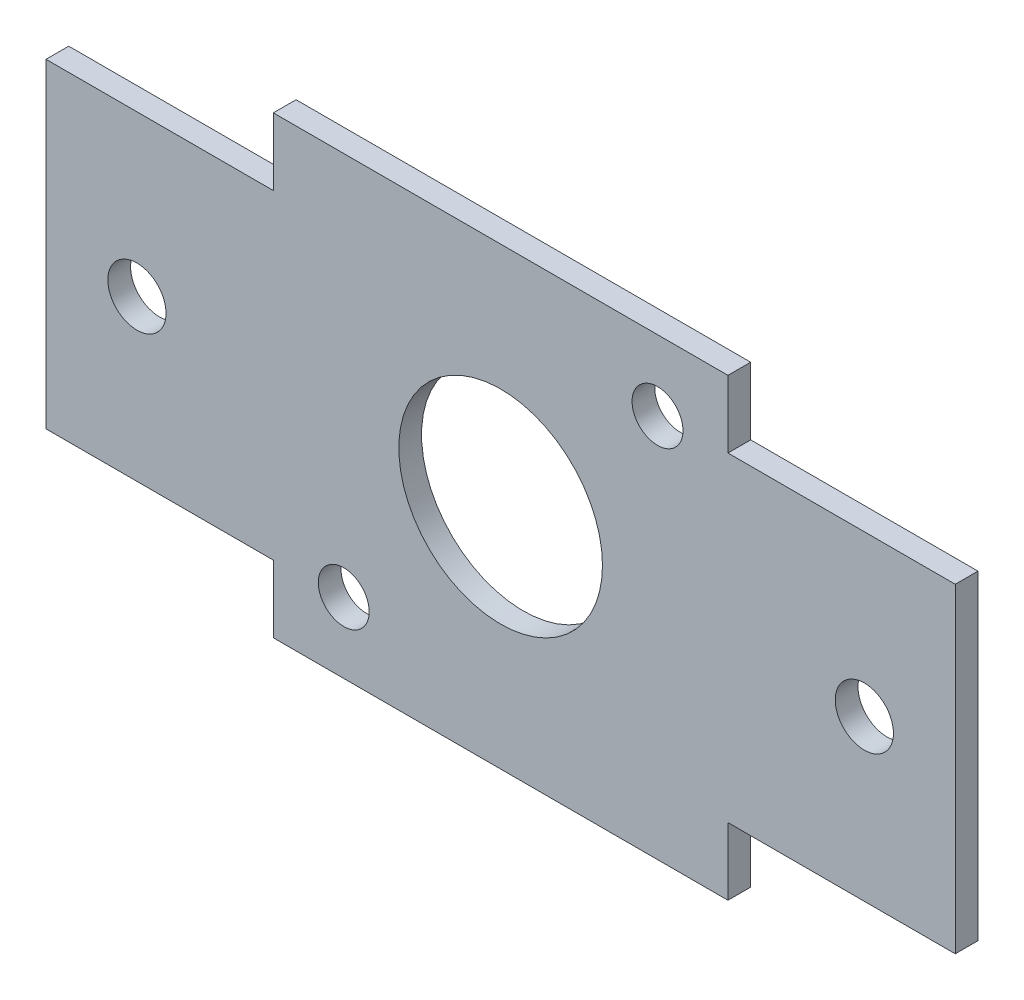
ISO-10303-21;
HEADER;
FILE_DESCRIPTION(('STEP AP214'),'2;1');
FILE_NAME('part.step','',(''),(''),'','','');
FILE_SCHEMA(('AUTOMOTIVE_DESIGN { 1 0 10303 214 1 1 1 1 }'));
ENDSEC;
DATA;
#1=APPLICATION_CONTEXT('core data for automotive mechanical design processes');
#2=APPLICATION_PROTOCOL_DEFINITION('international standard','automotive_design',2000,#1);
#3=PRODUCT_CONTEXT('',#1,'mechanical');
#4=PRODUCT('Part','Part','',(#3));
#5=PRODUCT_RELATED_PRODUCT_CATEGORY('part','',(#4));
#6=PRODUCT_DEFINITION_FORMATION('','',#4);
#7=PRODUCT_DEFINITION_CONTEXT('part definition',#1,'design');
#8=PRODUCT_DEFINITION('design','',#6,#7);
#9=PRODUCT_DEFINITION_SHAPE('','',#8);
#10=(LENGTH_UNIT() NAMED_UNIT(*) SI_UNIT(.MILLI.,.METRE.));
#11=(NAMED_UNIT(*) PLANE_ANGLE_UNIT() SI_UNIT($,.RADIAN.));
#12=(NAMED_UNIT(*) SI_UNIT($,.STERADIAN.) SOLID_ANGLE_UNIT());
#13=UNCERTAINTY_MEASURE_WITH_UNIT(LENGTH_MEASURE(1.E-05),#10,'distance_accuracy_value','');
#14=(GEOMETRIC_REPRESENTATION_CONTEXT(3) GLOBAL_UNCERTAINTY_ASSIGNED_CONTEXT((#13)) GLOBAL_UNIT_ASSIGNED_CONTEXT((#10,
#11,#12)) REPRESENTATION_CONTEXT('',''));
#15=CARTESIAN_POINT('',(0.,0.,0.));
#16=DIRECTION('',(0.,0.,1.));
#17=DIRECTION('',(1.,0.,0.));
#18=AXIS2_PLACEMENT_3D('',#15,#16,#17);
#19=CARTESIAN_POINT('',(-31.75,0.,1.5875));
#20=DIRECTION('',(-1.,0.,0.));
#21=DIRECTION('',(0.,0.,1.));
#22=AXIS2_PLACEMENT_3D('',#19,#20,#21);
#23=PLANE('',#22);
#24=DIRECTION('',(0.,1.,0.));
#25=VECTOR('',#24,1.);
#26=CARTESIAN_POINT('',(-31.75,0.,0.));
#27=LINE('',#26,#25);
#28=CARTESIAN_POINT('',(-31.75,-11.176,0.));
#29=VERTEX_POINT('',#28);
#30=CARTESIAN_POINT('',(-31.75,11.176,0.));
#31=VERTEX_POINT('',#30);
#32=EDGE_CURVE('E239',#29,#31,#27,.T.);
#33=ORIENTED_EDGE('',*,*,#32,.F.);
#34=DIRECTION('',(0.,0.,-1.));
#35=VECTOR('',#34,1.);
#36=CARTESIAN_POINT('',(-31.75,-11.176,1.5875));
#37=LINE('',#36,#35);
#38=CARTESIAN_POINT('',(-31.75,-11.176,1.5875));
#39=VERTEX_POINT('',#38);
#40=EDGE_CURVE('E11',#39,#29,#37,.T.);
#41=ORIENTED_EDGE('',*,*,#40,.F.);
#42=DIRECTION('',(0.,1.,0.));
#43=VECTOR('',#42,1.);
#44=CARTESIAN_POINT('',(-31.75,0.,1.5875));
#45=LINE('',#44,#43);
#46=CARTESIAN_POINT('',(-31.75,11.176,1.5875));
#47=VERTEX_POINT('',#46);
#48=EDGE_CURVE('E176',#39,#47,#45,.T.);
#49=ORIENTED_EDGE('',*,*,#48,.T.);
#50=DIRECTION('',(0.,0.,-1.));
#51=VECTOR('',#50,1.);
#52=CARTESIAN_POINT('',(-31.75,11.176,1.5875));
#53=LINE('',#52,#51);
#54=EDGE_CURVE('E103',#47,#31,#53,.T.);
#55=ORIENTED_EDGE('',*,*,#54,.T.);
#56=EDGE_LOOP('',(#33,#41,#49,#55));
#57=FACE_BOUND('',#56,.T.);
#58=ADVANCED_FACE('F39',(#57),#23,.T.);
#59=CARTESIAN_POINT('',(0.,-11.176,1.5875));
#60=DIRECTION('',(0.,-1.,0.));
#61=DIRECTION('',(0.,0.,-1.));
#62=AXIS2_PLACEMENT_3D('',#59,#60,#61);
#63=PLANE('',#62);
#64=DIRECTION('',(-1.,0.,0.));
#65=VECTOR('',#64,1.);
#66=CARTESIAN_POINT('',(0.,-11.176,0.));
#67=LINE('',#66,#65);
#68=CARTESIAN_POINT('',(-15.875,-11.176,0.));
#69=VERTEX_POINT('',#68);
#70=EDGE_CURVE('E234',#69,#29,#67,.T.);
#71=ORIENTED_EDGE('',*,*,#70,.F.);
#72=DIRECTION('',(0.,0.,-1.));
#73=VECTOR('',#72,1.);
#74=CARTESIAN_POINT('',(-15.875,-11.176,1.5875));
#75=LINE('',#74,#73);
#76=CARTESIAN_POINT('',(-15.875,-11.176,1.5875));
#77=VERTEX_POINT('',#76);
#78=EDGE_CURVE('E49',#77,#69,#75,.T.);
#79=ORIENTED_EDGE('',*,*,#78,.F.);
#80=DIRECTION('',(-1.,0.,0.));
#81=VECTOR('',#80,1.);
#82=CARTESIAN_POINT('',(0.,-11.176,1.5875));
#83=LINE('',#82,#81);
#84=EDGE_CURVE('E168',#77,#39,#83,.T.);
#85=ORIENTED_EDGE('',*,*,#84,.T.);
#86=ORIENTED_EDGE('',*,*,#40,.T.);
#87=EDGE_LOOP('',(#71,#79,#85,#86));
#88=FACE_BOUND('',#87,.T.);
#89=ADVANCED_FACE('F235',(#88),#63,.T.);
#90=CARTESIAN_POINT('',(-15.875,0.,1.5875));
#91=DIRECTION('',(-1.,0.,0.));
#92=DIRECTION('',(0.,0.,1.));
#93=AXIS2_PLACEMENT_3D('',#90,#91,#92);
#94=PLANE('',#93);
#95=DIRECTION('',(0.,1.,0.));
#96=VECTOR('',#95,1.);
#97=CARTESIAN_POINT('',(-15.875,0.,0.));
#98=LINE('',#97,#96);
#99=CARTESIAN_POINT('',(-15.875,-15.875,0.));
#100=VERTEX_POINT('',#99);
#101=EDGE_CURVE('E232',#100,#69,#98,.T.);
#102=ORIENTED_EDGE('',*,*,#101,.F.);
#103=DIRECTION('',(0.,0.,-1.));
#104=VECTOR('',#103,1.);
#105=CARTESIAN_POINT('',(-15.875,-15.875,1.5875));
#106=LINE('',#105,#104);
#107=CARTESIAN_POINT('',(-15.875,-15.875,1.5875));
#108=VERTEX_POINT('',#107);
#109=EDGE_CURVE('E225',#108,#100,#106,.T.);
#110=ORIENTED_EDGE('',*,*,#109,.F.);
#111=DIRECTION('',(0.,1.,0.));
#112=VECTOR('',#111,1.);
#113=CARTESIAN_POINT('',(-15.875,0.,1.5875));
#114=LINE('',#113,#112);
#115=EDGE_CURVE('E159',#108,#77,#114,.T.);
#116=ORIENTED_EDGE('',*,*,#115,.T.);
#117=ORIENTED_EDGE('',*,*,#78,.T.);
#118=EDGE_LOOP('',(#102,#110,#116,#117));
#119=FACE_BOUND('',#118,.T.);
#120=ADVANCED_FACE('F230',(#119),#94,.T.);
#121=CARTESIAN_POINT('',(0.,-15.875,1.5875));
#122=DIRECTION('',(0.,1.,0.));
#123=DIRECTION('',(0.,0.,1.));
#124=AXIS2_PLACEMENT_3D('',#121,#122,#123);
#125=PLANE('',#124);
#126=DIRECTION('',(1.,0.,0.));
#127=VECTOR('',#126,1.);
#128=CARTESIAN_POINT('',(0.,-15.875,0.));
#129=LINE('',#128,#127);
#130=CARTESIAN_POINT('',(15.875,-15.875,0.));
#131=VERTEX_POINT('',#130);
#132=EDGE_CURVE('E245',#100,#131,#129,.T.);
#133=ORIENTED_EDGE('',*,*,#132,.T.);
#134=DIRECTION('',(0.,0.,-1.));
#135=VECTOR('',#134,1.);
#136=CARTESIAN_POINT('',(15.875,-15.875,1.5875));
#137=LINE('',#136,#135);
#138=CARTESIAN_POINT('',(15.875,-15.875,1.5875));
#139=VERTEX_POINT('',#138);
#140=EDGE_CURVE('E221',#139,#131,#137,.T.);
#141=ORIENTED_EDGE('',*,*,#140,.F.);
#142=DIRECTION('',(1.,0.,0.));
#143=VECTOR('',#142,1.);
#144=CARTESIAN_POINT('',(0.,-15.875,1.5875));
#145=LINE('',#144,#143);
#146=EDGE_CURVE('E167',#108,#139,#145,.T.);
#147=ORIENTED_EDGE('',*,*,#146,.F.);
#148=ORIENTED_EDGE('',*,*,#109,.T.);
#149=EDGE_LOOP('',(#133,#141,#147,#148));
#150=FACE_BOUND('',#149,.T.);
#151=ADVANCED_FACE('F298',(#150),#125,.F.);
#152=CARTESIAN_POINT('',(15.875,0.,1.5875));
#153=DIRECTION('',(-1.,0.,0.));
#154=DIRECTION('',(0.,0.,1.));
#155=AXIS2_PLACEMENT_3D('',#152,#153,#154);
#156=PLANE('',#155);
#157=DIRECTION('',(0.,1.,0.));
#158=VECTOR('',#157,1.);
#159=CARTESIAN_POINT('',(15.875,0.,0.));
#160=LINE('',#159,#158);
#161=CARTESIAN_POINT('',(15.875,-11.176,0.));
#162=VERTEX_POINT('',#161);
#163=EDGE_CURVE('E250',#131,#162,#160,.T.);
#164=ORIENTED_EDGE('',*,*,#163,.T.);
#165=DIRECTION('',(0.,0.,-1.));
#166=VECTOR('',#165,1.);
#167=CARTESIAN_POINT('',(15.875,-11.176,1.5875));
#168=LINE('',#167,#166);
#169=CARTESIAN_POINT('',(15.875,-11.176,1.5875));
#170=VERTEX_POINT('',#169);
#171=EDGE_CURVE('E217',#170,#162,#168,.T.);
#172=ORIENTED_EDGE('',*,*,#171,.F.);
#173=DIRECTION('',(0.,1.,0.));
#174=VECTOR('',#173,1.);
#175=CARTESIAN_POINT('',(15.875,0.,1.5875));
#176=LINE('',#175,#174);
#177=EDGE_CURVE('E174',#139,#170,#176,.T.);
#178=ORIENTED_EDGE('',*,*,#177,.F.);
#179=ORIENTED_EDGE('',*,*,#140,.T.);
#180=EDGE_LOOP('',(#164,#172,#178,#179));
#181=FACE_BOUND('',#180,.T.);
#182=ADVANCED_FACE('F301',(#181),#156,.F.);
#183=CARTESIAN_POINT('',(0.,-11.176,1.5875));
#184=DIRECTION('',(0.,1.,0.));
#185=DIRECTION('',(0.,0.,1.));
#186=AXIS2_PLACEMENT_3D('',#183,#184,#185);
#187=PLANE('',#186);
#188=DIRECTION('',(1.,0.,0.));
#189=VECTOR('',#188,1.);
#190=CARTESIAN_POINT('',(0.,-11.176,0.));
#191=LINE('',#190,#189);
#192=CARTESIAN_POINT('',(31.75,-11.176,0.));
#193=VERTEX_POINT('',#192);
#194=EDGE_CURVE('E369',#162,#193,#191,.T.);
#195=ORIENTED_EDGE('',*,*,#194,.T.);
#196=DIRECTION('',(0.,0.,-1.));
#197=VECTOR('',#196,1.);
#198=CARTESIAN_POINT('',(31.75,-11.176,1.5875));
#199=LINE('',#198,#197);
#200=CARTESIAN_POINT('',(31.75,-11.176,1.5875));
#201=VERTEX_POINT('',#200);
#202=EDGE_CURVE('E213',#201,#193,#199,.T.);
#203=ORIENTED_EDGE('',*,*,#202,.F.);
#204=DIRECTION('',(1.,0.,0.));
#205=VECTOR('',#204,1.);
#206=CARTESIAN_POINT('',(0.,-11.176,1.5875));
#207=LINE('',#206,#205);
#208=EDGE_CURVE('E355',#170,#201,#207,.T.);
#209=ORIENTED_EDGE('',*,*,#208,.F.);
#210=ORIENTED_EDGE('',*,*,#171,.T.);
#211=EDGE_LOOP('',(#195,#203,#209,#210));
#212=FACE_BOUND('',#211,.T.);
#213=ADVANCED_FACE('F303',(#212),#187,.F.);
#214=CARTESIAN_POINT('',(31.75,0.,1.5875));
#215=DIRECTION('',(-1.,0.,0.));
#216=DIRECTION('',(0.,0.,1.));
#217=AXIS2_PLACEMENT_3D('',#214,#215,#216);
#218=PLANE('',#217);
#219=DIRECTION('',(0.,1.,0.));
#220=VECTOR('',#219,1.);
#221=CARTESIAN_POINT('',(31.75,0.,0.));
#222=LINE('',#221,#220);
#223=CARTESIAN_POINT('',(31.75,11.176,0.));
#224=VERTEX_POINT('',#223);
#225=EDGE_CURVE('E372',#193,#224,#222,.T.);
#226=ORIENTED_EDGE('',*,*,#225,.T.);
#227=DIRECTION('',(0.,0.,-1.));
#228=VECTOR('',#227,1.);
#229=CARTESIAN_POINT('',(31.75,11.176,1.5875));
#230=LINE('',#229,#228);
#231=CARTESIAN_POINT('',(31.75,11.176,1.5875));
#232=VERTEX_POINT('',#231);
#233=EDGE_CURVE('E210',#232,#224,#230,.T.);
#234=ORIENTED_EDGE('',*,*,#233,.F.);
#235=DIRECTION('',(0.,1.,0.));
#236=VECTOR('',#235,1.);
#237=CARTESIAN_POINT('',(31.75,0.,1.5875));
#238=LINE('',#237,#236);
#239=EDGE_CURVE('E352',#201,#232,#238,.T.);
#240=ORIENTED_EDGE('',*,*,#239,.F.);
#241=ORIENTED_EDGE('',*,*,#202,.T.);
#242=EDGE_LOOP('',(#226,#234,#240,#241));
#243=FACE_BOUND('',#242,.T.);
#244=ADVANCED_FACE('F306',(#243),#218,.F.);
#245=CARTESIAN_POINT('',(0.,11.176,1.5875));
#246=DIRECTION('',(0.,1.,0.));
#247=DIRECTION('',(-1.,0.,0.));
#248=AXIS2_PLACEMENT_3D('',#245,#246,#247);
#249=PLANE('',#248);
#250=DIRECTION('',(1.,0.,0.));
#251=VECTOR('',#250,1.);
#252=CARTESIAN_POINT('',(0.,11.176,0.));
#253=LINE('',#252,#251);
#254=CARTESIAN_POINT('',(15.875,11.176,0.));
#255=VERTEX_POINT('',#254);
#256=EDGE_CURVE('E263',#255,#224,#253,.T.);
#257=ORIENTED_EDGE('',*,*,#256,.F.);
#258=DIRECTION('',(0.,0.,-1.));
#259=VECTOR('',#258,1.);
#260=CARTESIAN_POINT('',(15.875,11.176,1.5875));
#261=LINE('',#260,#259);
#262=CARTESIAN_POINT('',(15.875,11.176,1.5875));
#263=VERTEX_POINT('',#262);
#264=EDGE_CURVE('E207',#263,#255,#261,.T.);
#265=ORIENTED_EDGE('',*,*,#264,.F.);
#266=DIRECTION('',(1.,0.,0.));
#267=VECTOR('',#266,1.);
#268=CARTESIAN_POINT('',(0.,11.176,1.5875));
#269=LINE('',#268,#267);
#270=EDGE_CURVE('E348',#263,#232,#269,.T.);
#271=ORIENTED_EDGE('',*,*,#270,.T.);
#272=ORIENTED_EDGE('',*,*,#233,.T.);
#273=EDGE_LOOP('',(#257,#265,#271,#272));
#274=FACE_BOUND('',#273,.T.);
#275=ADVANCED_FACE('F310',(#274),#249,.T.);
#276=CARTESIAN_POINT('',(15.875,15.875,0.));
#277=VERTEX_POINT('',#276);
#278=EDGE_CURVE('E258',#255,#277,#160,.T.);
#279=ORIENTED_EDGE('',*,*,#278,.T.);
#280=DIRECTION('',(0.,0.,-1.));
#281=VECTOR('',#280,1.);
#282=CARTESIAN_POINT('',(15.875,15.875,1.5875));
#283=LINE('',#282,#281);
#284=CARTESIAN_POINT('',(15.875,15.875,1.5875));
#285=VERTEX_POINT('',#284);
#286=EDGE_CURVE('E145',#285,#277,#283,.T.);
#287=ORIENTED_EDGE('',*,*,#286,.F.);
#288=EDGE_CURVE('E152',#263,#285,#176,.T.);
#289=ORIENTED_EDGE('',*,*,#288,.F.);
#290=ORIENTED_EDGE('',*,*,#264,.T.);
#291=EDGE_LOOP('',(#279,#287,#289,#290));
#292=FACE_BOUND('',#291,.T.);
#293=ADVANCED_FACE('F314',(#292),#156,.F.);
#294=CARTESIAN_POINT('',(0.,15.875,1.5875));
#295=DIRECTION('',(0.,1.,0.));
#296=DIRECTION('',(0.,0.,1.));
#297=AXIS2_PLACEMENT_3D('',#294,#295,#296);
#298=PLANE('',#297);
#299=DIRECTION('',(1.,0.,0.));
#300=VECTOR('',#299,1.);
#301=CARTESIAN_POINT('',(0.,15.875,0.));
#302=LINE('',#301,#300);
#303=CARTESIAN_POINT('',(-15.875,15.875,0.));
#304=VERTEX_POINT('',#303);
#305=EDGE_CURVE('E139',#304,#277,#302,.T.);
#306=ORIENTED_EDGE('',*,*,#305,.F.);
#307=DIRECTION('',(0.,0.,-1.));
#308=VECTOR('',#307,1.);
#309=CARTESIAN_POINT('',(-15.875,15.875,1.5875));
#310=LINE('',#309,#308);
#311=CARTESIAN_POINT('',(-15.875,15.875,1.5875));
#312=VERTEX_POINT('',#311);
#313=EDGE_CURVE('E134',#312,#304,#310,.T.);
#314=ORIENTED_EDGE('',*,*,#313,.F.);
#315=DIRECTION('',(1.,0.,0.));
#316=VECTOR('',#315,1.);
#317=CARTESIAN_POINT('',(0.,15.875,1.5875));
#318=LINE('',#317,#316);
#319=EDGE_CURVE('E137',#312,#285,#318,.T.);
#320=ORIENTED_EDGE('',*,*,#319,.T.);
#321=ORIENTED_EDGE('',*,*,#286,.T.);
#322=EDGE_LOOP('',(#306,#314,#320,#321));
#323=FACE_BOUND('',#322,.T.);
#324=ADVANCED_FACE('F136',(#323),#298,.T.);
#325=CARTESIAN_POINT('',(-15.875,11.176,0.));
#326=VERTEX_POINT('',#325);
#327=EDGE_CURVE('E248',#326,#304,#98,.T.);
#328=ORIENTED_EDGE('',*,*,#327,.F.);
#329=DIRECTION('',(0.,0.,-1.));
#330=VECTOR('',#329,1.);
#331=CARTESIAN_POINT('',(-15.875,11.176,1.5875));
#332=LINE('',#331,#330);
#333=CARTESIAN_POINT('',(-15.875,11.176,1.5875));
#334=VERTEX_POINT('',#333);
#335=EDGE_CURVE('E96',#334,#326,#332,.T.);
#336=ORIENTED_EDGE('',*,*,#335,.F.);
#337=EDGE_CURVE('E149',#334,#312,#114,.T.);
#338=ORIENTED_EDGE('',*,*,#337,.T.);
#339=ORIENTED_EDGE('',*,*,#313,.T.);
#340=EDGE_LOOP('',(#328,#336,#338,#339));
#341=FACE_BOUND('',#340,.T.);
#342=ADVANCED_FACE('F156',(#341),#94,.T.);
#343=CARTESIAN_POINT('',(10.9559124677044,10.9559124677044,1.5875));
#344=DIRECTION('',(0.,0.,-1.));
#345=DIRECTION('',(-1.,0.,0.));
#346=AXIS2_PLACEMENT_3D('',#343,#344,#345);
#347=CYLINDRICAL_SURFACE('',#346,1.778);
#348=CARTESIAN_POINT('',(10.9559124677044,10.9559124677044,1.5875));
#349=DIRECTION('',(0.,0.,1.));
#350=DIRECTION('',(1.,0.,0.));
#351=AXIS2_PLACEMENT_3D('',#348,#349,#350);
#352=CIRCLE('',#351,1.778);
#353=CARTESIAN_POINT('',(12.7339124677044,10.9559124677044,1.5875));
#354=VERTEX_POINT('',#353);
#355=EDGE_CURVE('E338',#354,#354,#352,.T.);
#356=ORIENTED_EDGE('',*,*,#355,.T.);
#357=EDGE_LOOP('',(#356));
#358=FACE_BOUND('',#357,.T.);
#359=CARTESIAN_POINT('',(10.9559124677044,10.9559124677044,0.));
#360=DIRECTION('',(0.,0.,1.));
#361=DIRECTION('',(1.,0.,0.));
#362=AXIS2_PLACEMENT_3D('',#359,#360,#361);
#363=CIRCLE('',#362,1.778);
#364=CARTESIAN_POINT('',(12.7339124677044,10.9559124677044,0.));
#365=VERTEX_POINT('',#364);
#366=EDGE_CURVE('E190',#365,#365,#363,.T.);
#367=ORIENTED_EDGE('',*,*,#366,.F.);
#368=EDGE_LOOP('',(#367));
#369=FACE_BOUND('',#368,.T.);
#370=ADVANCED_FACE('F279',(#358,#369),#347,.F.);
#371=CARTESIAN_POINT('',(-10.9559124677044,-10.9559124677044,1.5875));
#372=DIRECTION('',(0.,0.,-1.));
#373=DIRECTION('',(-1.,0.,0.));
#374=AXIS2_PLACEMENT_3D('',#371,#372,#373);
#375=CYLINDRICAL_SURFACE('',#374,1.778);
#376=CARTESIAN_POINT('',(-10.9559124677044,-10.9559124677044,1.5875));
#377=DIRECTION('',(0.,0.,1.));
#378=DIRECTION('',(1.,0.,0.));
#379=AXIS2_PLACEMENT_3D('',#376,#377,#378);
#380=CIRCLE('',#379,1.778);
#381=CARTESIAN_POINT('',(-9.17791246770437,-10.9559124677044,1.5875));
#382=VERTEX_POINT('',#381);
#383=EDGE_CURVE('E342',#382,#382,#380,.T.);
#384=ORIENTED_EDGE('',*,*,#383,.T.);
#385=EDGE_LOOP('',(#384));
#386=FACE_BOUND('',#385,.T.);
#387=CARTESIAN_POINT('',(-10.9559124677044,-10.9559124677044,0.));
#388=DIRECTION('',(0.,0.,1.));
#389=DIRECTION('',(1.,0.,0.));
#390=AXIS2_PLACEMENT_3D('',#387,#388,#389);
#391=CIRCLE('',#390,1.778);
#392=CARTESIAN_POINT('',(-9.17791246770437,-10.9559124677044,0.));
#393=VERTEX_POINT('',#392);
#394=EDGE_CURVE('E196',#393,#393,#391,.T.);
#395=ORIENTED_EDGE('',*,*,#394,.F.);
#396=EDGE_LOOP('',(#395));
#397=FACE_BOUND('',#396,.T.);
#398=ADVANCED_FACE('F276',(#386,#397),#375,.F.);
#399=CARTESIAN_POINT('',(0.,0.,1.5875));
#400=DIRECTION('',(0.,0.,-1.));
#401=DIRECTION('',(-1.,0.,0.));
#402=AXIS2_PLACEMENT_3D('',#399,#400,#401);
#403=CYLINDRICAL_SURFACE('',#402,7.112);
#404=CARTESIAN_POINT('',(0.,0.,1.5875));
#405=DIRECTION('',(0.,0.,1.));
#406=DIRECTION('',(1.,0.,0.));
#407=AXIS2_PLACEMENT_3D('',#404,#405,#406);
#408=CIRCLE('',#407,7.112);
#409=CARTESIAN_POINT('',(7.112,0.,1.5875));
#410=VERTEX_POINT('',#409);
#411=EDGE_CURVE('E161',#410,#410,#408,.T.);
#412=ORIENTED_EDGE('',*,*,#411,.T.);
#413=EDGE_LOOP('',(#412));
#414=FACE_BOUND('',#413,.T.);
#415=CARTESIAN_POINT('',(0.,0.,0.));
#416=DIRECTION('',(0.,0.,1.));
#417=DIRECTION('',(1.,0.,0.));
#418=AXIS2_PLACEMENT_3D('',#415,#416,#417);
#419=CIRCLE('',#418,7.112);
#420=CARTESIAN_POINT('',(7.112,0.,0.));
#421=VERTEX_POINT('',#420);
#422=EDGE_CURVE('E256',#421,#421,#419,.T.);
#423=ORIENTED_EDGE('',*,*,#422,.F.);
#424=EDGE_LOOP('',(#423));
#425=FACE_BOUND('',#424,.T.);
#426=ADVANCED_FACE('F278',(#414,#425),#403,.F.);
#427=CARTESIAN_POINT('',(0.,11.176,1.5875));
#428=DIRECTION('',(0.,-1.,0.));
#429=DIRECTION('',(1.,0.,0.));
#430=AXIS2_PLACEMENT_3D('',#427,#428,#429);
#431=PLANE('',#430);
#432=DIRECTION('',(-1.,0.,0.));
#433=VECTOR('',#432,1.);
#434=CARTESIAN_POINT('',(0.,11.176,0.));
#435=LINE('',#434,#433);
#436=EDGE_CURVE('E253',#326,#31,#435,.T.);
#437=ORIENTED_EDGE('',*,*,#436,.T.);
#438=ORIENTED_EDGE('',*,*,#54,.F.);
#439=DIRECTION('',(-1.,0.,0.));
#440=VECTOR('',#439,1.);
#441=CARTESIAN_POINT('',(0.,11.176,1.5875));
#442=LINE('',#441,#440);
#443=EDGE_CURVE('E57',#334,#47,#442,.T.);
#444=ORIENTED_EDGE('',*,*,#443,.F.);
#445=ORIENTED_EDGE('',*,*,#335,.T.);
#446=EDGE_LOOP('',(#437,#438,#444,#445));
#447=FACE_BOUND('',#446,.T.);
#448=ADVANCED_FACE('F286',(#447),#431,.F.);
#449=CARTESIAN_POINT('',(-25.4,0.,1.5875));
#450=DIRECTION('',(0.,0.,-1.));
#451=DIRECTION('',(-1.,0.,0.));
#452=AXIS2_PLACEMENT_3D('',#449,#450,#451);
#453=CYLINDRICAL_SURFACE('',#452,2.032);
#454=CARTESIAN_POINT('',(-25.4,0.,1.5875));
#455=DIRECTION('',(0.,0.,1.));
#456=DIRECTION('',(1.,0.,0.));
#457=AXIS2_PLACEMENT_3D('',#454,#455,#456);
#458=CIRCLE('',#457,2.032);
#459=CARTESIAN_POINT('',(-23.368,0.,1.5875));
#460=VERTEX_POINT('',#459);
#461=EDGE_CURVE('E180',#460,#460,#458,.T.);
#462=ORIENTED_EDGE('',*,*,#461,.T.);
#463=EDGE_LOOP('',(#462));
#464=FACE_BOUND('',#463,.T.);
#465=CARTESIAN_POINT('',(-25.4,0.,0.));
#466=DIRECTION('',(0.,0.,1.));
#467=DIRECTION('',(1.,0.,0.));
#468=AXIS2_PLACEMENT_3D('',#465,#466,#467);
#469=CIRCLE('',#468,2.032);
#470=CARTESIAN_POINT('',(-23.368,0.,0.));
#471=VERTEX_POINT('',#470);
#472=EDGE_CURVE('E329',#471,#471,#469,.T.);
#473=ORIENTED_EDGE('',*,*,#472,.F.);
#474=EDGE_LOOP('',(#473));
#475=FACE_BOUND('',#474,.T.);
#476=ADVANCED_FACE('F41',(#464,#475),#453,.F.);
#477=CARTESIAN_POINT('',(25.4,0.,1.5875));
#478=DIRECTION('',(0.,0.,-1.));
#479=DIRECTION('',(-1.,0.,0.));
#480=AXIS2_PLACEMENT_3D('',#477,#478,#479);
#481=CYLINDRICAL_SURFACE('',#480,2.032);
#482=CARTESIAN_POINT('',(25.4,0.,1.5875));
#483=DIRECTION('',(0.,0.,1.));
#484=DIRECTION('',(1.,0.,0.));
#485=AXIS2_PLACEMENT_3D('',#482,#483,#484);
#486=CIRCLE('',#485,2.032);
#487=CARTESIAN_POINT('',(27.432,0.,1.5875));
#488=VERTEX_POINT('',#487);
#489=EDGE_CURVE('E202',#488,#488,#486,.T.);
#490=ORIENTED_EDGE('',*,*,#489,.T.);
#491=EDGE_LOOP('',(#490));
#492=FACE_BOUND('',#491,.T.);
#493=CARTESIAN_POINT('',(25.4,0.,0.));
#494=DIRECTION('',(0.,0.,1.));
#495=DIRECTION('',(1.,0.,0.));
#496=AXIS2_PLACEMENT_3D('',#493,#494,#495);
#497=CIRCLE('',#496,2.032);
#498=CARTESIAN_POINT('',(27.432,0.,0.));
#499=VERTEX_POINT('',#498);
#500=EDGE_CURVE('E185',#499,#499,#497,.T.);
#501=ORIENTED_EDGE('',*,*,#500,.F.);
#502=EDGE_LOOP('',(#501));
#503=FACE_BOUND('',#502,.T.);
#504=ADVANCED_FACE('F327',(#492,#503),#481,.F.);
#505=CARTESIAN_POINT('',(0.,0.,1.5875));
#506=DIRECTION('',(0.,0.,1.));
#507=DIRECTION('',(1.,0.,0.));
#508=AXIS2_PLACEMENT_3D('',#505,#506,#507);
#509=PLANE('',#508);
#510=ORIENTED_EDGE('',*,*,#461,.F.);
#511=EDGE_LOOP('',(#510));
#512=FACE_BOUND('',#511,.T.);
#513=ORIENTED_EDGE('',*,*,#48,.F.);
#514=ORIENTED_EDGE('',*,*,#84,.F.);
#515=ORIENTED_EDGE('',*,*,#115,.F.);
#516=ORIENTED_EDGE('',*,*,#146,.T.);
#517=ORIENTED_EDGE('',*,*,#177,.T.);
#518=ORIENTED_EDGE('',*,*,#208,.T.);
#519=ORIENTED_EDGE('',*,*,#239,.T.);
#520=ORIENTED_EDGE('',*,*,#270,.F.);
#521=ORIENTED_EDGE('',*,*,#288,.T.);
#522=ORIENTED_EDGE('',*,*,#319,.F.);
#523=ORIENTED_EDGE('',*,*,#337,.F.);
#524=ORIENTED_EDGE('',*,*,#443,.T.);
#525=EDGE_LOOP('',(#513,#514,#515,#516,#517,#518,#519,#520,#521,#522,#523,#524));
#526=FACE_BOUND('',#525,.T.);
#527=ORIENTED_EDGE('',*,*,#411,.F.);
#528=EDGE_LOOP('',(#527));
#529=FACE_BOUND('',#528,.T.);
#530=ORIENTED_EDGE('',*,*,#383,.F.);
#531=EDGE_LOOP('',(#530));
#532=FACE_BOUND('',#531,.T.);
#533=ORIENTED_EDGE('',*,*,#355,.F.);
#534=EDGE_LOOP('',(#533));
#535=FACE_BOUND('',#534,.T.);
#536=ORIENTED_EDGE('',*,*,#489,.F.);
#537=EDGE_LOOP('',(#536));
#538=FACE_BOUND('',#537,.T.);
#539=ADVANCED_FACE('F147',(#512,#526,#529,#532,#535,#538),#509,.T.);
#540=CARTESIAN_POINT('',(0.,0.,0.));
#541=DIRECTION('',(0.,0.,1.));
#542=DIRECTION('',(1.,0.,0.));
#543=AXIS2_PLACEMENT_3D('',#540,#541,#542);
#544=PLANE('',#543);
#545=ORIENTED_EDGE('',*,*,#472,.T.);
#546=EDGE_LOOP('',(#545));
#547=FACE_BOUND('',#546,.T.);
#548=ORIENTED_EDGE('',*,*,#32,.T.);
#549=ORIENTED_EDGE('',*,*,#436,.F.);
#550=ORIENTED_EDGE('',*,*,#327,.T.);
#551=ORIENTED_EDGE('',*,*,#305,.T.);
#552=ORIENTED_EDGE('',*,*,#278,.F.);
#553=ORIENTED_EDGE('',*,*,#256,.T.);
#554=ORIENTED_EDGE('',*,*,#225,.F.);
#555=ORIENTED_EDGE('',*,*,#194,.F.);
#556=ORIENTED_EDGE('',*,*,#163,.F.);
#557=ORIENTED_EDGE('',*,*,#132,.F.);
#558=ORIENTED_EDGE('',*,*,#101,.T.);
#559=ORIENTED_EDGE('',*,*,#70,.T.);
#560=EDGE_LOOP('',(#548,#549,#550,#551,#552,#553,#554,#555,#556,#557,#558,#559));
#561=FACE_BOUND('',#560,.T.);
#562=ORIENTED_EDGE('',*,*,#422,.T.);
#563=EDGE_LOOP('',(#562));
#564=FACE_BOUND('',#563,.T.);
#565=ORIENTED_EDGE('',*,*,#394,.T.);
#566=EDGE_LOOP('',(#565));
#567=FACE_BOUND('',#566,.T.);
#568=ORIENTED_EDGE('',*,*,#366,.T.);
#569=EDGE_LOOP('',(#568));
#570=FACE_BOUND('',#569,.T.);
#571=ORIENTED_EDGE('',*,*,#500,.T.);
#572=EDGE_LOOP('',(#571));
#573=FACE_BOUND('',#572,.T.);
#574=ADVANCED_FACE('F242',(#547,#561,#564,#567,#570,#573),#544,.F.);
#575=CLOSED_SHELL('',(#58,#89,#120,#151,#182,#213,#244,#275,#293,#324,#342,#370,#398,#426,#448,
#476,#504,#539,#574));
#576=MANIFOLD_SOLID_BREP('B2',#575);
#577=ADVANCED_BREP_SHAPE_REPRESENTATION('',(#18,#576),#14);
#578=SHAPE_DEFINITION_REPRESENTATION(#9,#577);
ENDSEC;
END-ISO-10303-21;
